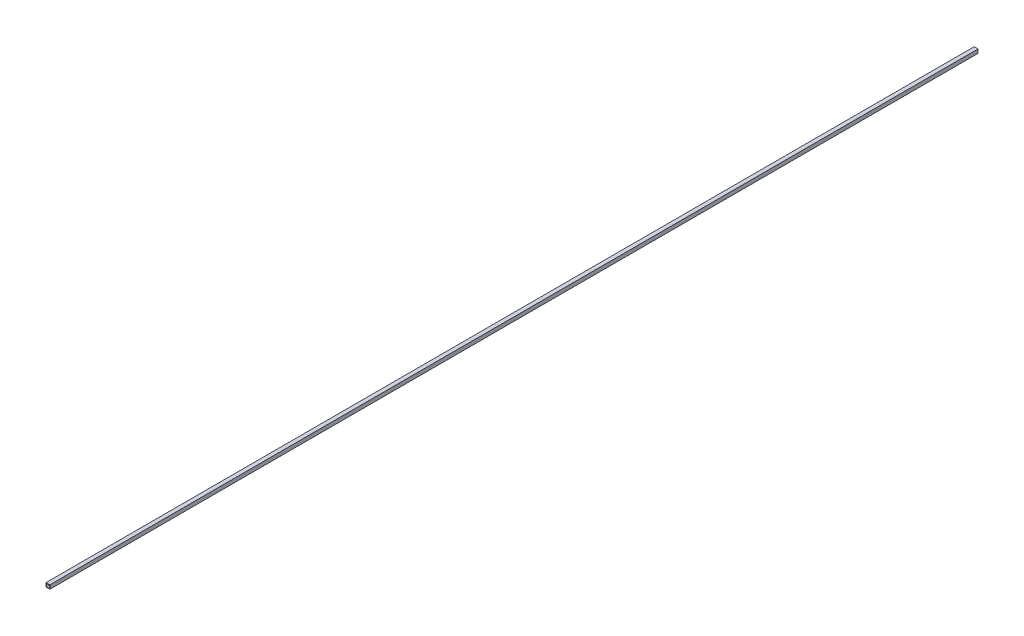
ISO-10303-21;
HEADER;
FILE_DESCRIPTION(('STEP AP214'),'2;1');
FILE_NAME('part.step','',(''),(''),'','','');
FILE_SCHEMA(('AUTOMOTIVE_DESIGN { 1 0 10303 214 1 1 1 1 }'));
ENDSEC;
DATA;
#1=APPLICATION_CONTEXT('core data for automotive mechanical design processes');
#2=APPLICATION_PROTOCOL_DEFINITION('international standard','automotive_design',2000,#1);
#3=PRODUCT_CONTEXT('',#1,'mechanical');
#4=PRODUCT('Part','Part','',(#3));
#5=PRODUCT_RELATED_PRODUCT_CATEGORY('part','',(#4));
#6=PRODUCT_DEFINITION_FORMATION('','',#4);
#7=PRODUCT_DEFINITION_CONTEXT('part definition',#1,'design');
#8=PRODUCT_DEFINITION('design','',#6,#7);
#9=PRODUCT_DEFINITION_SHAPE('','',#8);
#10=(LENGTH_UNIT() NAMED_UNIT(*) SI_UNIT(.MILLI.,.METRE.));
#11=(NAMED_UNIT(*) PLANE_ANGLE_UNIT() SI_UNIT($,.RADIAN.));
#12=(NAMED_UNIT(*) SI_UNIT($,.STERADIAN.) SOLID_ANGLE_UNIT());
#13=UNCERTAINTY_MEASURE_WITH_UNIT(LENGTH_MEASURE(1.E-05),#10,'distance_accuracy_value','');
#14=(GEOMETRIC_REPRESENTATION_CONTEXT(3) GLOBAL_UNCERTAINTY_ASSIGNED_CONTEXT((#13)) GLOBAL_UNIT_ASSIGNED_CONTEXT((#10,
#11,#12)) REPRESENTATION_CONTEXT('',''));
#15=CARTESIAN_POINT('',(0.,0.,0.));
#16=DIRECTION('',(0.,0.,1.));
#17=DIRECTION('',(1.,0.,0.));
#18=AXIS2_PLACEMENT_3D('',#15,#16,#17);
#19=CARTESIAN_POINT('',(0.,0.,1524.));
#20=DIRECTION('',(0.,0.,-1.));
#21=DIRECTION('',(-1.,0.,0.));
#22=AXIS2_PLACEMENT_3D('',#19,#20,#21);
#23=PLANE('',#22);
#24=DIRECTION('',(0.,1.,0.));
#25=VECTOR('',#24,1.);
#26=CARTESIAN_POINT('',(3.175,-3.175,1524.));
#27=LINE('',#26,#25);
#28=CARTESIAN_POINT('',(3.175,-3.175,1524.));
#29=VERTEX_POINT('',#28);
#30=CARTESIAN_POINT('',(3.175,3.175,1524.));
#31=VERTEX_POINT('',#30);
#32=EDGE_CURVE('E94',#29,#31,#27,.T.);
#33=ORIENTED_EDGE('',*,*,#32,.T.);
#34=DIRECTION('',(-1.,0.,0.));
#35=VECTOR('',#34,1.);
#36=CARTESIAN_POINT('',(-3.175,3.175,1524.));
#37=LINE('',#36,#35);
#38=CARTESIAN_POINT('',(-3.175,3.175,1524.));
#39=VERTEX_POINT('',#38);
#40=EDGE_CURVE('E89',#31,#39,#37,.T.);
#41=ORIENTED_EDGE('',*,*,#40,.T.);
#42=DIRECTION('',(0.,-1.,0.));
#43=VECTOR('',#42,1.);
#44=CARTESIAN_POINT('',(-3.175,-3.175,1524.));
#45=LINE('',#44,#43);
#46=CARTESIAN_POINT('',(-3.175,-3.175,1524.));
#47=VERTEX_POINT('',#46);
#48=EDGE_CURVE('E92',#39,#47,#45,.T.);
#49=ORIENTED_EDGE('',*,*,#48,.T.);
#50=DIRECTION('',(1.,0.,0.));
#51=VECTOR('',#50,1.);
#52=CARTESIAN_POINT('',(-3.175,-3.175,1524.));
#53=LINE('',#52,#51);
#54=EDGE_CURVE('E59',#47,#29,#53,.T.);
#55=ORIENTED_EDGE('',*,*,#54,.T.);
#56=EDGE_LOOP('',(#33,#41,#49,#55));
#57=FACE_BOUND('',#56,.T.);
#58=CARTESIAN_POINT('',(0.,0.,1524.));
#59=DIRECTION('',(0.,0.,1.));
#60=DIRECTION('',(1.,0.,0.));
#61=AXIS2_PLACEMENT_3D('',#58,#59,#60);
#62=CIRCLE('',#61,2.54);
#63=CARTESIAN_POINT('',(2.54,0.,1524.));
#64=VERTEX_POINT('',#63);
#65=EDGE_CURVE('E114',#64,#64,#62,.T.);
#66=ORIENTED_EDGE('',*,*,#65,.F.);
#67=EDGE_LOOP('',(#66));
#68=FACE_BOUND('',#67,.T.);
#69=ADVANCED_FACE('F41',(#57,#68),#23,.F.);
#70=CARTESIAN_POINT('',(0.,0.,0.));
#71=DIRECTION('',(0.,0.,-1.));
#72=DIRECTION('',(-1.,0.,0.));
#73=AXIS2_PLACEMENT_3D('',#70,#71,#72);
#74=PLANE('',#73);
#75=DIRECTION('',(0.,1.,0.));
#76=VECTOR('',#75,1.);
#77=CARTESIAN_POINT('',(3.175,-3.175,0.));
#78=LINE('',#77,#76);
#79=CARTESIAN_POINT('',(3.175,-3.175,0.));
#80=VERTEX_POINT('',#79);
#81=CARTESIAN_POINT('',(3.175,3.175,0.));
#82=VERTEX_POINT('',#81);
#83=EDGE_CURVE('E110',#80,#82,#78,.T.);
#84=ORIENTED_EDGE('',*,*,#83,.F.);
#85=DIRECTION('',(1.,0.,0.));
#86=VECTOR('',#85,1.);
#87=CARTESIAN_POINT('',(-3.175,-3.175,0.));
#88=LINE('',#87,#86);
#89=CARTESIAN_POINT('',(-3.175,-3.175,0.));
#90=VERTEX_POINT('',#89);
#91=EDGE_CURVE('E82',#90,#80,#88,.T.);
#92=ORIENTED_EDGE('',*,*,#91,.F.);
#93=DIRECTION('',(0.,-1.,0.));
#94=VECTOR('',#93,1.);
#95=CARTESIAN_POINT('',(-3.175,-3.175,0.));
#96=LINE('',#95,#94);
#97=CARTESIAN_POINT('',(-3.175,3.175,0.));
#98=VERTEX_POINT('',#97);
#99=EDGE_CURVE('E76',#98,#90,#96,.T.);
#100=ORIENTED_EDGE('',*,*,#99,.F.);
#101=DIRECTION('',(-1.,0.,0.));
#102=VECTOR('',#101,1.);
#103=CARTESIAN_POINT('',(-3.175,3.175,0.));
#104=LINE('',#103,#102);
#105=EDGE_CURVE('E99',#82,#98,#104,.T.);
#106=ORIENTED_EDGE('',*,*,#105,.F.);
#107=EDGE_LOOP('',(#84,#92,#100,#106));
#108=FACE_BOUND('',#107,.T.);
#109=CARTESIAN_POINT('',(0.,0.,0.));
#110=DIRECTION('',(0.,0.,1.));
#111=DIRECTION('',(1.,0.,0.));
#112=AXIS2_PLACEMENT_3D('',#109,#110,#111);
#113=CIRCLE('',#112,2.54);
#114=CARTESIAN_POINT('',(2.54,0.,0.));
#115=VERTEX_POINT('',#114);
#116=EDGE_CURVE('E132',#115,#115,#113,.T.);
#117=ORIENTED_EDGE('',*,*,#116,.T.);
#118=EDGE_LOOP('',(#117));
#119=FACE_BOUND('',#118,.T.);
#120=ADVANCED_FACE('F127',(#108,#119),#74,.T.);
#121=CARTESIAN_POINT('',(3.175,-3.175,1524.));
#122=DIRECTION('',(-1.,0.,0.));
#123=DIRECTION('',(0.,0.,1.));
#124=AXIS2_PLACEMENT_3D('',#121,#122,#123);
#125=PLANE('',#124);
#126=ORIENTED_EDGE('',*,*,#83,.T.);
#127=DIRECTION('',(0.,0.,-1.));
#128=VECTOR('',#127,1.);
#129=CARTESIAN_POINT('',(3.175,3.175,1524.));
#130=LINE('',#129,#128);
#131=EDGE_CURVE('E11',#31,#82,#130,.T.);
#132=ORIENTED_EDGE('',*,*,#131,.F.);
#133=ORIENTED_EDGE('',*,*,#32,.F.);
#134=DIRECTION('',(0.,0.,-1.));
#135=VECTOR('',#134,1.);
#136=CARTESIAN_POINT('',(3.175,-3.175,1524.));
#137=LINE('',#136,#135);
#138=EDGE_CURVE('E106',#29,#80,#137,.T.);
#139=ORIENTED_EDGE('',*,*,#138,.T.);
#140=EDGE_LOOP('',(#126,#132,#133,#139));
#141=FACE_BOUND('',#140,.T.);
#142=ADVANCED_FACE('F43',(#141),#125,.F.);
#143=CARTESIAN_POINT('',(-3.175,3.175,1524.));
#144=DIRECTION('',(0.,-1.,0.));
#145=DIRECTION('',(0.,0.,-1.));
#146=AXIS2_PLACEMENT_3D('',#143,#144,#145);
#147=PLANE('',#146);
#148=ORIENTED_EDGE('',*,*,#105,.T.);
#149=DIRECTION('',(0.,0.,-1.));
#150=VECTOR('',#149,1.);
#151=CARTESIAN_POINT('',(-3.175,3.175,1524.));
#152=LINE('',#151,#150);
#153=EDGE_CURVE('E51',#39,#98,#152,.T.);
#154=ORIENTED_EDGE('',*,*,#153,.F.);
#155=ORIENTED_EDGE('',*,*,#40,.F.);
#156=ORIENTED_EDGE('',*,*,#131,.T.);
#157=EDGE_LOOP('',(#148,#154,#155,#156));
#158=FACE_BOUND('',#157,.T.);
#159=ADVANCED_FACE('F98',(#158),#147,.F.);
#160=CARTESIAN_POINT('',(-3.175,-3.175,1524.));
#161=DIRECTION('',(1.,0.,0.));
#162=DIRECTION('',(0.,0.,-1.));
#163=AXIS2_PLACEMENT_3D('',#160,#161,#162);
#164=PLANE('',#163);
#165=ORIENTED_EDGE('',*,*,#99,.T.);
#166=DIRECTION('',(0.,0.,-1.));
#167=VECTOR('',#166,1.);
#168=CARTESIAN_POINT('',(-3.175,-3.175,1524.));
#169=LINE('',#168,#167);
#170=EDGE_CURVE('E101',#47,#90,#169,.T.);
#171=ORIENTED_EDGE('',*,*,#170,.F.);
#172=ORIENTED_EDGE('',*,*,#48,.F.);
#173=ORIENTED_EDGE('',*,*,#153,.T.);
#174=EDGE_LOOP('',(#165,#171,#172,#173));
#175=FACE_BOUND('',#174,.T.);
#176=ADVANCED_FACE('F102',(#175),#164,.F.);
#177=CARTESIAN_POINT('',(-3.175,-3.175,1524.));
#178=DIRECTION('',(0.,1.,0.));
#179=DIRECTION('',(0.,0.,1.));
#180=AXIS2_PLACEMENT_3D('',#177,#178,#179);
#181=PLANE('',#180);
#182=ORIENTED_EDGE('',*,*,#91,.T.);
#183=ORIENTED_EDGE('',*,*,#138,.F.);
#184=ORIENTED_EDGE('',*,*,#54,.F.);
#185=ORIENTED_EDGE('',*,*,#170,.T.);
#186=EDGE_LOOP('',(#182,#183,#184,#185));
#187=FACE_BOUND('',#186,.T.);
#188=ADVANCED_FACE('F124',(#187),#181,.F.);
#189=CARTESIAN_POINT('',(0.,0.,1524.));
#190=DIRECTION('',(0.,0.,-1.));
#191=DIRECTION('',(-1.,0.,0.));
#192=AXIS2_PLACEMENT_3D('',#189,#190,#191);
#193=CYLINDRICAL_SURFACE('',#192,2.54);
#194=ORIENTED_EDGE('',*,*,#65,.T.);
#195=EDGE_LOOP('',(#194));
#196=FACE_BOUND('',#195,.T.);
#197=ORIENTED_EDGE('',*,*,#116,.F.);
#198=EDGE_LOOP('',(#197));
#199=FACE_BOUND('',#198,.T.);
#200=ADVANCED_FACE('F140',(#196,#199),#193,.F.);
#201=CLOSED_SHELL('',(#69,#120,#142,#159,#176,#188,#200));
#202=MANIFOLD_SOLID_BREP('B2',#201);
#203=ADVANCED_BREP_SHAPE_REPRESENTATION('',(#18,#202),#14);
#204=SHAPE_DEFINITION_REPRESENTATION(#9,#203);
ENDSEC;
END-ISO-10303-21;
